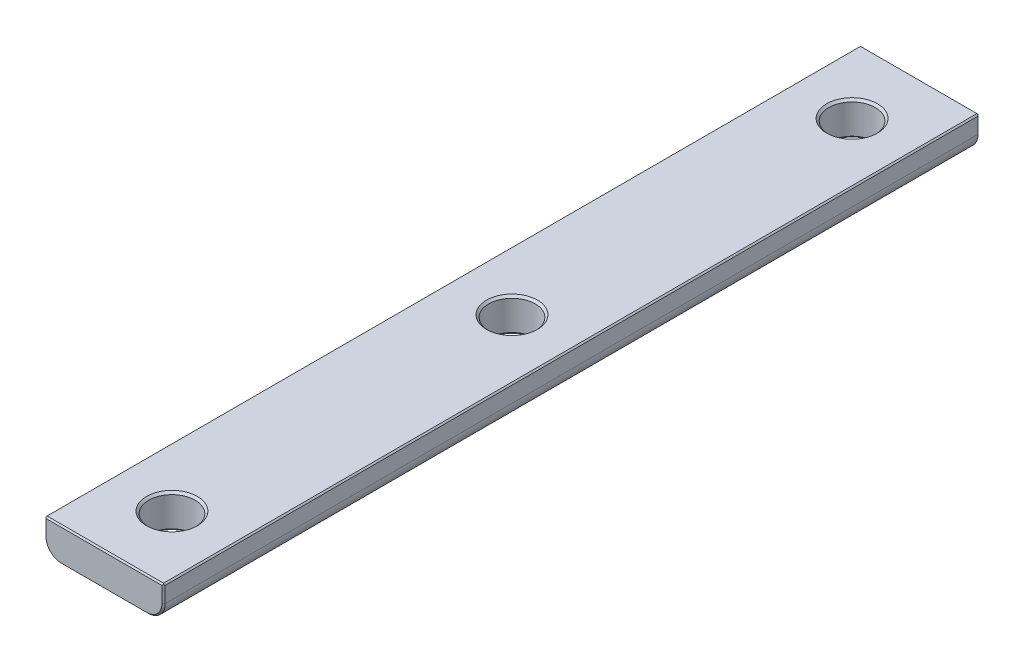
ISO-10303-21;
HEADER;
FILE_DESCRIPTION(('STEP AP214'),'2;1');
FILE_NAME('part.step','',(''),(''),'','','');
FILE_SCHEMA(('AUTOMOTIVE_DESIGN { 1 0 10303 214 1 1 1 1 }'));
ENDSEC;
DATA;
#1=APPLICATION_CONTEXT('core data for automotive mechanical design processes');
#2=APPLICATION_PROTOCOL_DEFINITION('international standard','automotive_design',2000,#1);
#3=PRODUCT_CONTEXT('',#1,'mechanical');
#4=PRODUCT('Part','Part','',(#3));
#5=PRODUCT_RELATED_PRODUCT_CATEGORY('part','',(#4));
#6=PRODUCT_DEFINITION_FORMATION('','',#4);
#7=PRODUCT_DEFINITION_CONTEXT('part definition',#1,'design');
#8=PRODUCT_DEFINITION('design','',#6,#7);
#9=PRODUCT_DEFINITION_SHAPE('','',#8);
#10=(LENGTH_UNIT() NAMED_UNIT(*) SI_UNIT(.MILLI.,.METRE.));
#11=(NAMED_UNIT(*) PLANE_ANGLE_UNIT() SI_UNIT($,.RADIAN.));
#12=(NAMED_UNIT(*) SI_UNIT($,.STERADIAN.) SOLID_ANGLE_UNIT());
#13=UNCERTAINTY_MEASURE_WITH_UNIT(LENGTH_MEASURE(1.E-05),#10,'distance_accuracy_value','');
#14=(GEOMETRIC_REPRESENTATION_CONTEXT(3) GLOBAL_UNCERTAINTY_ASSIGNED_CONTEXT((#13)) GLOBAL_UNIT_ASSIGNED_CONTEXT((#10,
#11,#12)) REPRESENTATION_CONTEXT('',''));
#15=CARTESIAN_POINT('',(0.,0.,0.));
#16=DIRECTION('',(0.,0.,1.));
#17=DIRECTION('',(1.,0.,0.));
#18=AXIS2_PLACEMENT_3D('',#15,#16,#17);
#19=CARTESIAN_POINT('',(4.147312,6.5659,-39.465504));
#20=DIRECTION('',(0.,-1.,0.));
#21=DIRECTION('',(0.,0.,1.));
#22=AXIS2_PLACEMENT_3D('',#19,#20,#21);
#23=PLANE('',#22);
#24=CARTESIAN_POINT('',(0.,6.56590000000372,-31.75));
#25=DIRECTION('',(0.,-1.,0.));
#26=DIRECTION('',(0.,0.,-1.));
#27=AXIS2_PLACEMENT_3D('',#24,#25,#26);
#28=CIRCLE('',#27,2.37490000000372);
#29=CARTESIAN_POINT('',(0.,6.56590000000372,-34.1249000000037));
#30=VERTEX_POINT('',#29);
#31=EDGE_CURVE('E189',#30,#30,#28,.F.);
#32=ORIENTED_EDGE('',*,*,#31,.T.);
#33=EDGE_LOOP('',(#32));
#34=FACE_BOUND('',#33,.T.);
#35=CARTESIAN_POINT('',(0.,6.56590000000373,31.75));
#36=DIRECTION('',(0.,-1.,0.));
#37=DIRECTION('',(1.,0.,0.));
#38=AXIS2_PLACEMENT_3D('',#35,#36,#37);
#39=CIRCLE('',#38,2.37490000000372);
#40=CARTESIAN_POINT('',(2.37490000000372,6.56590000000373,31.75));
#41=VERTEX_POINT('',#40);
#42=EDGE_CURVE('E192',#41,#41,#39,.F.);
#43=ORIENTED_EDGE('',*,*,#42,.T.);
#44=EDGE_LOOP('',(#43));
#45=FACE_BOUND('',#44,.T.);
#46=CARTESIAN_POINT('',(0.,6.56590000000037,0.));
#47=DIRECTION('',(0.,-1.,0.));
#48=DIRECTION('',(0.,0.,-1.));
#49=AXIS2_PLACEMENT_3D('',#46,#47,#48);
#50=CIRCLE('',#49,2.37490000000037);
#51=CARTESIAN_POINT('',(0.,6.56590000000037,-2.37490000000037));
#52=VERTEX_POINT('',#51);
#53=EDGE_CURVE('E195',#52,#52,#50,.F.);
#54=ORIENTED_EDGE('',*,*,#53,.T.);
#55=EDGE_LOOP('',(#54));
#56=FACE_BOUND('',#55,.T.);
#57=DIRECTION('',(0.,0.,1.));
#58=VECTOR('',#57,1.);
#59=CARTESIAN_POINT('',(3.9878,6.5659,0.));
#60=LINE('',#59,#58);
#61=CARTESIAN_POINT('',(3.9878,6.56590000000164,-37.9475999999984));
#62=VERTEX_POINT('',#61);
#63=CARTESIAN_POINT('',(3.9878,6.56590000000245,37.9475999999976));
#64=VERTEX_POINT('',#63);
#65=EDGE_CURVE('E117',#62,#64,#60,.T.);
#66=ORIENTED_EDGE('',*,*,#65,.T.);
#67=DIRECTION('',(-1.,0.,0.));
#68=VECTOR('',#67,1.);
#69=CARTESIAN_POINT('',(0.,6.56590000000327,37.9475999999967));
#70=LINE('',#69,#68);
#71=CARTESIAN_POINT('',(-3.9878,6.56590000000164,37.9475999999984));
#72=VERTEX_POINT('',#71);
#73=EDGE_CURVE('E271',#64,#72,#70,.T.);
#74=ORIENTED_EDGE('',*,*,#73,.T.);
#75=DIRECTION('',(0.,0.,-1.));
#76=VECTOR('',#75,1.);
#77=CARTESIAN_POINT('',(-3.9878,6.5659,0.));
#78=LINE('',#77,#76);
#79=CARTESIAN_POINT('',(-3.9878,6.56590000000164,-37.947599999998));
#80=VERTEX_POINT('',#79);
#81=EDGE_CURVE('E244',#72,#80,#78,.T.);
#82=ORIENTED_EDGE('',*,*,#81,.T.);
#83=DIRECTION('',(1.,0.,0.));
#84=VECTOR('',#83,1.);
#85=CARTESIAN_POINT('',(0.,6.56590000000327,-37.9475999999967));
#86=LINE('',#85,#84);
#87=EDGE_CURVE('E144',#80,#62,#86,.T.);
#88=ORIENTED_EDGE('',*,*,#87,.T.);
#89=EDGE_LOOP('',(#66,#74,#82,#88));
#90=FACE_BOUND('',#89,.T.);
#91=ADVANCED_FACE('F15',(#34,#45,#56,#90),#23,.T.);
#92=CARTESIAN_POINT('',(-3.9878,8.1407,-37.9475999999967));
#93=DIRECTION('',(0.,0.,1.));
#94=DIRECTION('',(1.,0.,0.));
#95=AXIS2_PLACEMENT_3D('',#92,#93,#94);
#96=CONICAL_SURFACE('',#95,1.57479999999673,0.785398163354578);
#97=CARTESIAN_POINT('',(-3.9878,8.1407,-37.9476));
#98=DIRECTION('',(0.,0.,-1.));
#99=DIRECTION('',(0.,-1.,0.));
#100=AXIS2_PLACEMENT_3D('',#97,#98,#99);
#101=CIRCLE('',#100,1.5748);
#102=CARTESIAN_POINT('',(-5.56259999999918,8.1407,-37.947599999999));
#103=VERTEX_POINT('',#102);
#104=EDGE_CURVE('E209',#80,#103,#101,.T.);
#105=ORIENTED_EDGE('',*,*,#104,.T.);
#106=DIRECTION('',(-0.707106781156225,0.,0.70710678121687));
#107=VECTOR('',#106,1.);
#108=CARTESIAN_POINT('',(-5.4864,8.1407,-38.0238));
#109=LINE('',#108,#107);
#110=CARTESIAN_POINT('',(-5.41020000000164,8.1407,-38.1000000000033));
#111=VERTEX_POINT('',#110);
#112=EDGE_CURVE('E203',#103,#111,#109,.F.);
#113=ORIENTED_EDGE('',*,*,#112,.T.);
#114=CARTESIAN_POINT('',(-3.9878,8.1407,-38.1000000000033));
#115=DIRECTION('',(0.,0.,1.));
#116=DIRECTION('',(1.,0.,0.));
#117=AXIS2_PLACEMENT_3D('',#114,#115,#116);
#118=CIRCLE('',#117,1.42240000000327);
#119=CARTESIAN_POINT('',(-3.9878,6.71829999999837,-38.1000000000033));
#120=VERTEX_POINT('',#119);
#121=EDGE_CURVE('E186',#111,#120,#118,.T.);
#122=ORIENTED_EDGE('',*,*,#121,.T.);
#123=DIRECTION('',(0.,-0.707106781156225,0.70710678121687));
#124=VECTOR('',#123,1.);
#125=CARTESIAN_POINT('',(-3.9878,6.6421,-38.0238));
#126=LINE('',#125,#124);
#127=EDGE_CURVE('E147',#120,#80,#126,.T.);
#128=ORIENTED_EDGE('',*,*,#127,.T.);
#129=EDGE_LOOP('',(#105,#113,#122,#128));
#130=FACE_BOUND('',#129,.T.);
#131=ADVANCED_FACE('F321',(#130),#96,.T.);
#132=CARTESIAN_POINT('',(-4.147312,6.4940223329733,-37.8757223329606));
#133=DIRECTION('',(0.,0.70710678121687,0.707106781156225));
#134=DIRECTION('',(1.,0.,0.));
#135=AXIS2_PLACEMENT_3D('',#132,#133,#134);
#136=PLANE('',#135);
#137=DIRECTION('',(-1.,0.,0.));
#138=VECTOR('',#137,1.);
#139=CARTESIAN_POINT('',(0.,6.7183,-38.1));
#140=LINE('',#139,#138);
#141=CARTESIAN_POINT('',(3.9878,6.71829999999837,-38.1000000000033));
#142=VERTEX_POINT('',#141);
#143=EDGE_CURVE('E185',#120,#142,#140,.F.);
#144=ORIENTED_EDGE('',*,*,#143,.T.);
#145=DIRECTION('',(0.,-0.707106781156225,0.70710678121687));
#146=VECTOR('',#145,1.);
#147=CARTESIAN_POINT('',(3.9878,6.6421,-38.0238));
#148=LINE('',#147,#146);
#149=EDGE_CURVE('E225',#142,#62,#148,.T.);
#150=ORIENTED_EDGE('',*,*,#149,.T.);
#151=ORIENTED_EDGE('',*,*,#87,.F.);
#152=ORIENTED_EDGE('',*,*,#127,.F.);
#153=EDGE_LOOP('',(#144,#150,#151,#152));
#154=FACE_BOUND('',#153,.T.);
#155=ADVANCED_FACE('F308',(#154),#136,.F.);
#156=CARTESIAN_POINT('',(3.9878,8.1407,-38.1000000000033));
#157=DIRECTION('',(0.,0.,1.));
#158=DIRECTION('',(1.,0.,0.));
#159=AXIS2_PLACEMENT_3D('',#156,#157,#158);
#160=CONICAL_SURFACE('',#159,1.42240000000327,0.78539816335457);
#161=CARTESIAN_POINT('',(3.9878,8.1407,-37.9476));
#162=DIRECTION('',(0.,0.,1.));
#163=DIRECTION('',(0.,-1.,0.));
#164=AXIS2_PLACEMENT_3D('',#161,#162,#163);
#165=CIRCLE('',#164,1.5748);
#166=CARTESIAN_POINT('',(5.56259999999918,8.1407,-37.947599999999));
#167=VERTEX_POINT('',#166);
#168=EDGE_CURVE('E228',#167,#62,#165,.F.);
#169=ORIENTED_EDGE('',*,*,#168,.T.);
#170=ORIENTED_EDGE('',*,*,#149,.F.);
#171=CARTESIAN_POINT('',(3.9878,8.1407,-38.1000000000033));
#172=DIRECTION('',(0.,0.,1.));
#173=DIRECTION('',(1.,0.,0.));
#174=AXIS2_PLACEMENT_3D('',#171,#172,#173);
#175=CIRCLE('',#174,1.42240000000327);
#176=CARTESIAN_POINT('',(5.41020000000163,8.1407,-38.1000000000033));
#177=VERTEX_POINT('',#176);
#178=EDGE_CURVE('E181',#142,#177,#175,.T.);
#179=ORIENTED_EDGE('',*,*,#178,.T.);
#180=DIRECTION('',(-0.707106781156225,0.,-0.70710678121687));
#181=VECTOR('',#180,1.);
#182=CARTESIAN_POINT('',(5.4864,8.1407,-38.0238));
#183=LINE('',#182,#181);
#184=EDGE_CURVE('E214',#177,#167,#183,.F.);
#185=ORIENTED_EDGE('',*,*,#184,.T.);
#186=EDGE_LOOP('',(#169,#170,#179,#185));
#187=FACE_BOUND('',#186,.T.);
#188=ADVANCED_FACE('F294',(#187),#160,.T.);
#189=CARTESIAN_POINT('',(3.9878,8.1407,-37.9476));
#190=DIRECTION('',(0.,0.,1.));
#191=DIRECTION('',(1.,0.,0.));
#192=AXIS2_PLACEMENT_3D('',#189,#190,#191);
#193=CYLINDRICAL_SURFACE('',#192,1.5748);
#194=ORIENTED_EDGE('',*,*,#65,.F.);
#195=ORIENTED_EDGE('',*,*,#168,.F.);
#196=DIRECTION('',(0.,0.,-1.));
#197=VECTOR('',#196,1.);
#198=CARTESIAN_POINT('',(5.5626,8.1407,0.));
#199=LINE('',#198,#197);
#200=CARTESIAN_POINT('',(5.56259999999837,8.1407,37.9475999999976));
#201=VERTEX_POINT('',#200);
#202=EDGE_CURVE('E125',#167,#201,#199,.F.);
#203=ORIENTED_EDGE('',*,*,#202,.T.);
#204=CARTESIAN_POINT('',(3.9878,8.1407,37.9475999999967));
#205=DIRECTION('',(0.,0.,1.));
#206=DIRECTION('',(0.,-1.,0.));
#207=AXIS2_PLACEMENT_3D('',#204,#205,#206);
#208=CIRCLE('',#207,1.57479999999673);
#209=EDGE_CURVE('E268',#201,#64,#208,.F.);
#210=ORIENTED_EDGE('',*,*,#209,.T.);
#211=EDGE_LOOP('',(#194,#195,#203,#210));
#212=FACE_BOUND('',#211,.T.);
#213=ADVANCED_FACE('F300',(#212),#193,.T.);
#214=CARTESIAN_POINT('',(5.6344776670267,9.79175037154264,-37.8757223329606));
#215=DIRECTION('',(0.70710678121687,0.,-0.707106781156225));
#216=DIRECTION('',(0.,-1.,0.));
#217=AXIS2_PLACEMENT_3D('',#214,#215,#216);
#218=PLANE('',#217);
#219=DIRECTION('',(0.,-1.,0.));
#220=VECTOR('',#219,1.);
#221=CARTESIAN_POINT('',(5.4102,8.1661,-38.1));
#222=LINE('',#221,#220);
#223=CARTESIAN_POINT('',(5.41020000000245,9.61390000000205,-38.1000000000015));
#224=VERTEX_POINT('',#223);
#225=EDGE_CURVE('E184',#177,#224,#222,.F.);
#226=ORIENTED_EDGE('',*,*,#225,.T.);
#227=DIRECTION('',(-0.577350269164863,-0.577350269177639,-0.577350269226375));
#228=VECTOR('',#227,1.);
#229=CARTESIAN_POINT('',(5.4864,9.69009999999883,-38.0237999999988));
#230=LINE('',#229,#228);
#231=CARTESIAN_POINT('',(5.48639999999979,9.69009999999855,-38.0237999999992));
#232=VERTEX_POINT('',#231);
#233=EDGE_CURVE('E113',#232,#224,#230,.T.);
#234=ORIENTED_EDGE('',*,*,#233,.F.);
#235=DIRECTION('',(-0.577350269174537,0.577350269179952,-0.577350269214388));
#236=VECTOR('',#235,1.);
#237=CARTESIAN_POINT('',(5.56259999999743,9.6139000000007,-37.9475999999967));
#238=LINE('',#237,#236);
#239=CARTESIAN_POINT('',(5.5625999999993,9.61389999999907,-37.9475999999975));
#240=VERTEX_POINT('',#239);
#241=EDGE_CURVE('E19',#240,#232,#238,.T.);
#242=ORIENTED_EDGE('',*,*,#241,.F.);
#243=DIRECTION('',(0.,1.,0.));
#244=VECTOR('',#243,1.);
#245=CARTESIAN_POINT('',(5.5626,8.8773,-37.9476));
#246=LINE('',#245,#244);
#247=EDGE_CURVE('E112',#240,#167,#246,.F.);
#248=ORIENTED_EDGE('',*,*,#247,.T.);
#249=ORIENTED_EDGE('',*,*,#184,.F.);
#250=EDGE_LOOP('',(#226,#234,#242,#248,#249));
#251=FACE_BOUND('',#250,.T.);
#252=ADVANCED_FACE('F111',(#251),#218,.T.);
#253=CARTESIAN_POINT('',(-3.9878,8.1407,38.1000000000033));
#254=DIRECTION('',(0.,0.,-1.));
#255=DIRECTION('',(-1.,0.,0.));
#256=AXIS2_PLACEMENT_3D('',#253,#254,#255);
#257=CONICAL_SURFACE('',#256,1.42240000000327,0.78539816335457);
#258=CARTESIAN_POINT('',(-3.9878,8.1407,37.9476));
#259=DIRECTION('',(0.,0.,-1.));
#260=DIRECTION('',(0.,-1.,0.));
#261=AXIS2_PLACEMENT_3D('',#258,#259,#260);
#262=CIRCLE('',#261,1.5748);
#263=CARTESIAN_POINT('',(-5.56259999999918,8.1407,37.9475999999984));
#264=VERTEX_POINT('',#263);
#265=EDGE_CURVE('E241',#264,#72,#262,.F.);
#266=ORIENTED_EDGE('',*,*,#265,.T.);
#267=DIRECTION('',(0.,0.707106781156225,0.70710678121687));
#268=VECTOR('',#267,1.);
#269=CARTESIAN_POINT('',(-3.9878,6.6421,38.0238));
#270=LINE('',#269,#268);
#271=CARTESIAN_POINT('',(-3.9878,6.71829999999837,38.1000000000033));
#272=VERTEX_POINT('',#271);
#273=EDGE_CURVE('E276',#72,#272,#270,.T.);
#274=ORIENTED_EDGE('',*,*,#273,.T.);
#275=CARTESIAN_POINT('',(-3.9878,8.1407,38.1000000000033));
#276=DIRECTION('',(0.,0.,-1.));
#277=DIRECTION('',(-1.,0.,0.));
#278=AXIS2_PLACEMENT_3D('',#275,#276,#277);
#279=CIRCLE('',#278,1.42240000000327);
#280=CARTESIAN_POINT('',(-5.41020000000164,8.1407,38.1000000000033));
#281=VERTEX_POINT('',#280);
#282=EDGE_CURVE('E127',#272,#281,#279,.T.);
#283=ORIENTED_EDGE('',*,*,#282,.T.);
#284=DIRECTION('',(0.707106781156225,0.,0.70710678121687));
#285=VECTOR('',#284,1.);
#286=CARTESIAN_POINT('',(-5.4864,8.1407,38.0238));
#287=LINE('',#286,#285);
#288=EDGE_CURVE('E198',#281,#264,#287,.F.);
#289=ORIENTED_EDGE('',*,*,#288,.T.);
#290=EDGE_LOOP('',(#266,#274,#283,#289));
#291=FACE_BOUND('',#290,.T.);
#292=ADVANCED_FACE('F361',(#291),#257,.T.);
#293=CARTESIAN_POINT('',(5.3383223329733,9.79175037154264,38.1718776670394));
#294=DIRECTION('',(0.70710678121687,0.,0.707106781156225));
#295=DIRECTION('',(0.,-1.,0.));
#296=AXIS2_PLACEMENT_3D('',#293,#294,#295);
#297=PLANE('',#296);
#298=DIRECTION('',(0.,-1.,0.));
#299=VECTOR('',#298,1.);
#300=CARTESIAN_POINT('',(5.5626,8.8773,37.9476));
#301=LINE('',#300,#299);
#302=CARTESIAN_POINT('',(5.5625999999993,9.61389999999907,37.9475999999976));
#303=VERTEX_POINT('',#302);
#304=EDGE_CURVE('E128',#201,#303,#301,.F.);
#305=ORIENTED_EDGE('',*,*,#304,.T.);
#306=DIRECTION('',(0.577350269174519,-0.577350269179934,-0.577350269214423));
#307=VECTOR('',#306,1.);
#308=CARTESIAN_POINT('',(5.48639999999943,9.69009999999943,38.0238));
#309=LINE('',#308,#307);
#310=CARTESIAN_POINT('',(5.48640000000016,9.69009999999869,38.023799999999));
#311=VERTEX_POINT('',#310);
#312=EDGE_CURVE('E132',#311,#303,#309,.T.);
#313=ORIENTED_EDGE('',*,*,#312,.F.);
#314=DIRECTION('',(0.577350269164868,0.577350269177637,-0.577350269226373));
#315=VECTOR('',#314,1.);
#316=CARTESIAN_POINT('',(5.41020000000327,9.61390000000042,38.1000000000037));
#317=LINE('',#316,#315);
#318=CARTESIAN_POINT('',(5.41020000000245,9.61390000000205,38.1000000000015));
#319=VERTEX_POINT('',#318);
#320=EDGE_CURVE('E212',#319,#311,#317,.T.);
#321=ORIENTED_EDGE('',*,*,#320,.F.);
#322=DIRECTION('',(0.,1.,0.));
#323=VECTOR('',#322,1.);
#324=CARTESIAN_POINT('',(5.4102,8.1661,38.1));
#325=LINE('',#324,#323);
#326=CARTESIAN_POINT('',(5.41020000000163,8.1407,38.1000000000033));
#327=VERTEX_POINT('',#326);
#328=EDGE_CURVE('E177',#319,#327,#325,.F.);
#329=ORIENTED_EDGE('',*,*,#328,.T.);
#330=DIRECTION('',(0.707106781156225,0.,-0.70710678121687));
#331=VECTOR('',#330,1.);
#332=CARTESIAN_POINT('',(5.4864,8.1407,38.0238));
#333=LINE('',#332,#331);
#334=EDGE_CURVE('E211',#327,#201,#333,.T.);
#335=ORIENTED_EDGE('',*,*,#334,.T.);
#336=EDGE_LOOP('',(#305,#313,#321,#329,#335));
#337=FACE_BOUND('',#336,.T.);
#338=ADVANCED_FACE('F392',(#337),#297,.T.);
#339=CARTESIAN_POINT('',(3.9878,8.1407,37.9475999999967));
#340=DIRECTION('',(0.,0.,-1.));
#341=DIRECTION('',(-1.,0.,0.));
#342=AXIS2_PLACEMENT_3D('',#339,#340,#341);
#343=CONICAL_SURFACE('',#342,1.57479999999673,0.785398163354578);
#344=ORIENTED_EDGE('',*,*,#209,.F.);
#345=ORIENTED_EDGE('',*,*,#334,.F.);
#346=CARTESIAN_POINT('',(3.9878,8.1407,38.1000000000033));
#347=DIRECTION('',(0.,0.,-1.));
#348=DIRECTION('',(-1.,0.,0.));
#349=AXIS2_PLACEMENT_3D('',#346,#347,#348);
#350=CIRCLE('',#349,1.42240000000327);
#351=CARTESIAN_POINT('',(3.9878,6.71829999999837,38.1000000000033));
#352=VERTEX_POINT('',#351);
#353=EDGE_CURVE('E173',#327,#352,#350,.T.);
#354=ORIENTED_EDGE('',*,*,#353,.T.);
#355=DIRECTION('',(0.,-0.707106781156225,-0.70710678121687));
#356=VECTOR('',#355,1.);
#357=CARTESIAN_POINT('',(3.9878,6.6421,38.0238));
#358=LINE('',#357,#356);
#359=EDGE_CURVE('E245',#352,#64,#358,.T.);
#360=ORIENTED_EDGE('',*,*,#359,.T.);
#361=EDGE_LOOP('',(#344,#345,#354,#360));
#362=FACE_BOUND('',#361,.T.);
#363=ADVANCED_FACE('F384',(#362),#343,.T.);
#364=CARTESIAN_POINT('',(4.147312,6.4940223329733,37.8757223329606));
#365=DIRECTION('',(0.,0.70710678121687,-0.707106781156225));
#366=DIRECTION('',(-1.,0.,0.));
#367=AXIS2_PLACEMENT_3D('',#364,#365,#366);
#368=PLANE('',#367);
#369=DIRECTION('',(1.,0.,0.));
#370=VECTOR('',#369,1.);
#371=CARTESIAN_POINT('',(0.,6.7183,38.1));
#372=LINE('',#371,#370);
#373=EDGE_CURVE('E176',#352,#272,#372,.F.);
#374=ORIENTED_EDGE('',*,*,#373,.T.);
#375=ORIENTED_EDGE('',*,*,#273,.F.);
#376=ORIENTED_EDGE('',*,*,#73,.F.);
#377=ORIENTED_EDGE('',*,*,#359,.F.);
#378=EDGE_LOOP('',(#374,#375,#376,#377));
#379=FACE_BOUND('',#378,.T.);
#380=ADVANCED_FACE('F382',(#379),#368,.F.);
#381=CARTESIAN_POINT('',(-3.9878,8.1407,37.9476));
#382=DIRECTION('',(0.,0.,-1.));
#383=DIRECTION('',(-1.,0.,0.));
#384=AXIS2_PLACEMENT_3D('',#381,#382,#383);
#385=CYLINDRICAL_SURFACE('',#384,1.5748);
#386=ORIENTED_EDGE('',*,*,#81,.F.);
#387=ORIENTED_EDGE('',*,*,#265,.F.);
#388=DIRECTION('',(0.,0.,1.));
#389=VECTOR('',#388,1.);
#390=CARTESIAN_POINT('',(-5.5626,8.1407,0.));
#391=LINE('',#390,#389);
#392=EDGE_CURVE('E235',#264,#103,#391,.F.);
#393=ORIENTED_EDGE('',*,*,#392,.T.);
#394=ORIENTED_EDGE('',*,*,#104,.F.);
#395=EDGE_LOOP('',(#386,#387,#393,#394));
#396=FACE_BOUND('',#395,.T.);
#397=ADVANCED_FACE('F316',(#396),#385,.T.);
#398=CARTESIAN_POINT('',(-5.3383223329733,9.79175037154264,-38.1718776670394));
#399=DIRECTION('',(-0.70710678121687,0.,-0.707106781156225));
#400=DIRECTION('',(0.,-1.,0.));
#401=AXIS2_PLACEMENT_3D('',#398,#399,#400);
#402=PLANE('',#401);
#403=DIRECTION('',(0.,-1.,0.));
#404=VECTOR('',#403,1.);
#405=CARTESIAN_POINT('',(-5.5626,8.8773,-37.9476));
#406=LINE('',#405,#404);
#407=CARTESIAN_POINT('',(-5.5625999999993,9.61389999999907,-37.9475999999976));
#408=VERTEX_POINT('',#407);
#409=EDGE_CURVE('E238',#103,#408,#406,.F.);
#410=ORIENTED_EDGE('',*,*,#409,.T.);
#411=DIRECTION('',(-0.577350269174519,-0.577350269179941,0.577350269214417));
#412=VECTOR('',#411,1.);
#413=CARTESIAN_POINT('',(-5.48639999999943,9.69009999999943,-38.0238));
#414=LINE('',#413,#412);
#415=CARTESIAN_POINT('',(-5.48639999999979,9.69009999999855,-38.0237999999992));
#416=VERTEX_POINT('',#415);
#417=EDGE_CURVE('E204',#416,#408,#414,.T.);
#418=ORIENTED_EDGE('',*,*,#417,.F.);
#419=DIRECTION('',(-0.577350269164841,0.577350269177643,0.577350269226393));
#420=VECTOR('',#419,1.);
#421=CARTESIAN_POINT('',(-5.41020000000327,9.61390000000041,-38.1000000000037));
#422=LINE('',#421,#420);
#423=CARTESIAN_POINT('',(-5.41020000000245,9.61390000000205,-38.1000000000015));
#424=VERTEX_POINT('',#423);
#425=EDGE_CURVE('E206',#424,#416,#422,.T.);
#426=ORIENTED_EDGE('',*,*,#425,.F.);
#427=DIRECTION('',(0.,1.,0.));
#428=VECTOR('',#427,1.);
#429=CARTESIAN_POINT('',(-5.4102,8.1661,-38.1));
#430=LINE('',#429,#428);
#431=EDGE_CURVE('E284',#424,#111,#430,.F.);
#432=ORIENTED_EDGE('',*,*,#431,.T.);
#433=ORIENTED_EDGE('',*,*,#112,.F.);
#434=EDGE_LOOP('',(#410,#418,#426,#432,#433));
#435=FACE_BOUND('',#434,.T.);
#436=ADVANCED_FACE('F374',(#435),#402,.T.);
#437=CARTESIAN_POINT('',(-5.6344776670267,9.79175037154264,37.8757223329606));
#438=DIRECTION('',(-0.70710678121687,0.,0.707106781156225));
#439=DIRECTION('',(0.,-1.,0.));
#440=AXIS2_PLACEMENT_3D('',#437,#438,#439);
#441=PLANE('',#440);
#442=DIRECTION('',(0.,-1.,0.));
#443=VECTOR('',#442,1.);
#444=CARTESIAN_POINT('',(-5.4102,8.1661,38.1));
#445=LINE('',#444,#443);
#446=CARTESIAN_POINT('',(-5.41020000000245,9.61390000000205,38.1000000000015));
#447=VERTEX_POINT('',#446);
#448=EDGE_CURVE('E180',#281,#447,#445,.F.);
#449=ORIENTED_EDGE('',*,*,#448,.T.);
#450=DIRECTION('',(0.577350269164863,-0.577350269177639,0.577350269226375));
#451=VECTOR('',#450,1.);
#452=CARTESIAN_POINT('',(-5.4864,9.69009999999883,38.0237999999988));
#453=LINE('',#452,#451);
#454=CARTESIAN_POINT('',(-5.48639999999979,9.69009999999855,38.0237999999992));
#455=VERTEX_POINT('',#454);
#456=EDGE_CURVE('E199',#455,#447,#453,.T.);
#457=ORIENTED_EDGE('',*,*,#456,.F.);
#458=DIRECTION('',(0.577350269174537,0.577350269179952,0.577350269214388));
#459=VECTOR('',#458,1.);
#460=CARTESIAN_POINT('',(-5.56259999999743,9.6139000000007,37.9475999999967));
#461=LINE('',#460,#459);
#462=CARTESIAN_POINT('',(-5.5625999999993,9.61389999999907,37.9475999999975));
#463=VERTEX_POINT('',#462);
#464=EDGE_CURVE('E201',#463,#455,#461,.T.);
#465=ORIENTED_EDGE('',*,*,#464,.F.);
#466=DIRECTION('',(0.,1.,0.));
#467=VECTOR('',#466,1.);
#468=CARTESIAN_POINT('',(-5.5626,8.8773,37.9476));
#469=LINE('',#468,#467);
#470=EDGE_CURVE('E248',#463,#264,#469,.F.);
#471=ORIENTED_EDGE('',*,*,#470,.T.);
#472=ORIENTED_EDGE('',*,*,#288,.F.);
#473=EDGE_LOOP('',(#449,#457,#465,#471,#472));
#474=FACE_BOUND('',#473,.T.);
#475=ADVANCED_FACE('F367',(#474),#441,.T.);
#476=CARTESIAN_POINT('',(0.,6.56590000000037,0.));
#477=DIRECTION('',(0.,-1.,0.));
#478=DIRECTION('',(0.,0.,-1.));
#479=AXIS2_PLACEMENT_3D('',#476,#477,#478);
#480=CONICAL_SURFACE('',#479,2.37490000000037,0.785398163401112);
#481=CARTESIAN_POINT('',(0.,6.7691,0.));
#482=DIRECTION('',(0.,1.,0.));
#483=DIRECTION('',(0.,0.,1.));
#484=AXIS2_PLACEMENT_3D('',#481,#482,#483);
#485=CIRCLE('',#484,2.1717);
#486=CARTESIAN_POINT('',(0.,6.7691,2.1717));
#487=VERTEX_POINT('',#486);
#488=EDGE_CURVE('E251',#487,#487,#485,.T.);
#489=ORIENTED_EDGE('',*,*,#488,.T.);
#490=EDGE_LOOP('',(#489));
#491=FACE_BOUND('',#490,.T.);
#492=ORIENTED_EDGE('',*,*,#53,.F.);
#493=EDGE_LOOP('',(#492));
#494=FACE_BOUND('',#493,.T.);
#495=ADVANCED_FACE('F457',(#491,#494),#480,.F.);
#496=CARTESIAN_POINT('',(0.,6.56590000000372,31.75));
#497=DIRECTION('',(0.,-1.,0.));
#498=DIRECTION('',(1.,0.,0.));
#499=AXIS2_PLACEMENT_3D('',#496,#497,#498);
#500=CONICAL_SURFACE('',#499,2.37490000000373,0.785398163434057);
#501=CARTESIAN_POINT('',(0.,6.7691,31.75));
#502=DIRECTION('',(0.,1.,0.));
#503=DIRECTION('',(0.,0.,1.));
#504=AXIS2_PLACEMENT_3D('',#501,#502,#503);
#505=CIRCLE('',#504,2.1717);
#506=CARTESIAN_POINT('',(0.,6.7691,33.9217));
#507=VERTEX_POINT('',#506);
#508=EDGE_CURVE('E336',#507,#507,#505,.T.);
#509=ORIENTED_EDGE('',*,*,#508,.T.);
#510=EDGE_LOOP('',(#509));
#511=FACE_BOUND('',#510,.T.);
#512=ORIENTED_EDGE('',*,*,#42,.F.);
#513=EDGE_LOOP('',(#512));
#514=FACE_BOUND('',#513,.T.);
#515=ADVANCED_FACE('F453',(#511,#514),#500,.F.);
#516=CARTESIAN_POINT('',(0.,6.56590000000372,-31.75));
#517=DIRECTION('',(0.,-1.,0.));
#518=DIRECTION('',(0.,0.,-1.));
#519=AXIS2_PLACEMENT_3D('',#516,#517,#518);
#520=CONICAL_SURFACE('',#519,2.37490000000372,0.785398163434057);
#521=CARTESIAN_POINT('',(0.,6.7691,-31.75));
#522=DIRECTION('',(0.,1.,0.));
#523=DIRECTION('',(0.,0.,1.));
#524=AXIS2_PLACEMENT_3D('',#521,#522,#523);
#525=CIRCLE('',#524,2.1717);
#526=CARTESIAN_POINT('',(0.,6.7691,-29.5783));
#527=VERTEX_POINT('',#526);
#528=EDGE_CURVE('E333',#527,#527,#525,.T.);
#529=ORIENTED_EDGE('',*,*,#528,.T.);
#530=EDGE_LOOP('',(#529));
#531=FACE_BOUND('',#530,.T.);
#532=ORIENTED_EDGE('',*,*,#31,.F.);
#533=EDGE_LOOP('',(#532));
#534=FACE_BOUND('',#533,.T.);
#535=ADVANCED_FACE('F450',(#531,#534),#520,.F.);
#536=CARTESIAN_POINT('',(-5.626608,9.71555037154264,-38.1));
#537=DIRECTION('',(0.,0.,-1.));
#538=DIRECTION('',(1.,0.,0.));
#539=AXIS2_PLACEMENT_3D('',#536,#537,#538);
#540=PLANE('',#539);
#541=DIRECTION('',(-1.,0.,0.));
#542=VECTOR('',#541,1.);
#543=CARTESIAN_POINT('',(0.,9.61390000000205,-38.100000000002));
#544=LINE('',#543,#542);
#545=EDGE_CURVE('E139',#424,#224,#544,.F.);
#546=ORIENTED_EDGE('',*,*,#545,.T.);
#547=ORIENTED_EDGE('',*,*,#225,.F.);
#548=ORIENTED_EDGE('',*,*,#178,.F.);
#549=ORIENTED_EDGE('',*,*,#143,.F.);
#550=ORIENTED_EDGE('',*,*,#121,.F.);
#551=ORIENTED_EDGE('',*,*,#431,.F.);
#552=EDGE_LOOP('',(#546,#547,#548,#549,#550,#551));
#553=FACE_BOUND('',#552,.T.);
#554=ADVANCED_FACE('F327',(#553),#540,.T.);
#555=CARTESIAN_POINT('',(5.5626,9.71555037154264,-39.465504));
#556=DIRECTION('',(1.,0.,0.));
#557=DIRECTION('',(0.,0.,1.));
#558=AXIS2_PLACEMENT_3D('',#555,#556,#557);
#559=PLANE('',#558);
#560=DIRECTION('',(0.,0.,-1.));
#561=VECTOR('',#560,1.);
#562=CARTESIAN_POINT('',(5.56259999999907,9.61389999999907,0.));
#563=LINE('',#562,#561);
#564=EDGE_CURVE('E123',#240,#303,#563,.F.);
#565=ORIENTED_EDGE('',*,*,#564,.T.);
#566=ORIENTED_EDGE('',*,*,#304,.F.);
#567=ORIENTED_EDGE('',*,*,#202,.F.);
#568=ORIENTED_EDGE('',*,*,#247,.F.);
#569=EDGE_LOOP('',(#565,#566,#567,#568));
#570=FACE_BOUND('',#569,.T.);
#571=ADVANCED_FACE('F121',(#570),#559,.T.);
#572=CARTESIAN_POINT('',(5.626608,9.71555037154264,38.1));
#573=DIRECTION('',(0.,0.,1.));
#574=DIRECTION('',(-1.,0.,0.));
#575=AXIS2_PLACEMENT_3D('',#572,#573,#574);
#576=PLANE('',#575);
#577=ORIENTED_EDGE('',*,*,#353,.F.);
#578=ORIENTED_EDGE('',*,*,#328,.F.);
#579=DIRECTION('',(1.,0.,0.));
#580=VECTOR('',#579,1.);
#581=CARTESIAN_POINT('',(0.,9.61390000000205,38.100000000002));
#582=LINE('',#581,#580);
#583=EDGE_CURVE('E137',#319,#447,#582,.F.);
#584=ORIENTED_EDGE('',*,*,#583,.T.);
#585=ORIENTED_EDGE('',*,*,#448,.F.);
#586=ORIENTED_EDGE('',*,*,#282,.F.);
#587=ORIENTED_EDGE('',*,*,#373,.F.);
#588=EDGE_LOOP('',(#577,#578,#584,#585,#586,#587));
#589=FACE_BOUND('',#588,.T.);
#590=ADVANCED_FACE('F389',(#589),#576,.T.);
#591=CARTESIAN_POINT('',(-5.5626,9.71555037154264,39.465504));
#592=DIRECTION('',(-1.,0.,0.));
#593=DIRECTION('',(0.,0.,-1.));
#594=AXIS2_PLACEMENT_3D('',#591,#592,#593);
#595=PLANE('',#594);
#596=DIRECTION('',(0.,0.,1.));
#597=VECTOR('',#596,1.);
#598=CARTESIAN_POINT('',(-5.56259999999907,9.61389999999907,0.));
#599=LINE('',#598,#597);
#600=EDGE_CURVE('E171',#463,#408,#599,.F.);
#601=ORIENTED_EDGE('',*,*,#600,.T.);
#602=ORIENTED_EDGE('',*,*,#409,.F.);
#603=ORIENTED_EDGE('',*,*,#392,.F.);
#604=ORIENTED_EDGE('',*,*,#470,.F.);
#605=EDGE_LOOP('',(#601,#602,#603,#604));
#606=FACE_BOUND('',#605,.T.);
#607=ADVANCED_FACE('F370',(#606),#595,.T.);
#608=CARTESIAN_POINT('',(0.,6.7691,0.));
#609=DIRECTION('',(0.,1.,0.));
#610=DIRECTION('',(-1.,0.,0.));
#611=AXIS2_PLACEMENT_3D('',#608,#609,#610);
#612=CYLINDRICAL_SURFACE('',#611,2.1717);
#613=ORIENTED_EDGE('',*,*,#488,.F.);
#614=EDGE_LOOP('',(#613));
#615=FACE_BOUND('',#614,.T.);
#616=CARTESIAN_POINT('',(0.,9.53769999999937,0.));
#617=DIRECTION('',(0.,1.,0.));
#618=DIRECTION('',(0.,0.,1.));
#619=AXIS2_PLACEMENT_3D('',#616,#617,#618);
#620=CIRCLE('',#619,2.17170000000064);
#621=CARTESIAN_POINT('',(0.,9.53769999999937,2.17170000000064));
#622=VERTEX_POINT('',#621);
#623=EDGE_CURVE('E170',#622,#622,#620,.T.);
#624=ORIENTED_EDGE('',*,*,#623,.T.);
#625=EDGE_LOOP('',(#624));
#626=FACE_BOUND('',#625,.T.);
#627=ADVANCED_FACE('F445',(#615,#626),#612,.F.);
#628=CARTESIAN_POINT('',(0.,6.7691,31.75));
#629=DIRECTION('',(0.,1.,0.));
#630=DIRECTION('',(-1.,0.,0.));
#631=AXIS2_PLACEMENT_3D('',#628,#629,#630);
#632=CYLINDRICAL_SURFACE('',#631,2.1717);
#633=ORIENTED_EDGE('',*,*,#508,.F.);
#634=EDGE_LOOP('',(#633));
#635=FACE_BOUND('',#634,.T.);
#636=CARTESIAN_POINT('',(0.,9.53770000000271,31.75));
#637=DIRECTION('',(0.,1.,0.));
#638=DIRECTION('',(0.,0.,1.));
#639=AXIS2_PLACEMENT_3D('',#636,#637,#638);
#640=CIRCLE('',#639,2.17169999999729);
#641=CARTESIAN_POINT('',(0.,9.53770000000271,33.9216999999973));
#642=VERTEX_POINT('',#641);
#643=EDGE_CURVE('E739',#642,#642,#640,.T.);
#644=ORIENTED_EDGE('',*,*,#643,.T.);
#645=EDGE_LOOP('',(#644));
#646=FACE_BOUND('',#645,.T.);
#647=ADVANCED_FACE('F441',(#635,#646),#632,.F.);
#648=CARTESIAN_POINT('',(0.,6.7691,-31.75));
#649=DIRECTION('',(0.,1.,0.));
#650=DIRECTION('',(-1.,0.,0.));
#651=AXIS2_PLACEMENT_3D('',#648,#649,#650);
#652=CYLINDRICAL_SURFACE('',#651,2.1717);
#653=ORIENTED_EDGE('',*,*,#528,.F.);
#654=EDGE_LOOP('',(#653));
#655=FACE_BOUND('',#654,.T.);
#656=CARTESIAN_POINT('',(0.,9.53770000000272,-31.75));
#657=DIRECTION('',(0.,1.,0.));
#658=DIRECTION('',(0.,0.,1.));
#659=AXIS2_PLACEMENT_3D('',#656,#657,#658);
#660=CIRCLE('',#659,2.17169999999729);
#661=CARTESIAN_POINT('',(0.,9.53770000000272,-29.5783000000027));
#662=VERTEX_POINT('',#661);
#663=EDGE_CURVE('E157',#662,#662,#660,.T.);
#664=ORIENTED_EDGE('',*,*,#663,.T.);
#665=EDGE_LOOP('',(#664));
#666=FACE_BOUND('',#665,.T.);
#667=ADVANCED_FACE('F438',(#655,#666),#652,.F.);
#668=CARTESIAN_POINT('',(-5.705856,9.8127776670267,-37.9011223329606));
#669=DIRECTION('',(0.,0.707106781216396,-0.707106781156699));
#670=DIRECTION('',(1.,0.,0.));
#671=AXIS2_PLACEMENT_3D('',#668,#669,#670);
#672=PLANE('',#671);
#673=ORIENTED_EDGE('',*,*,#233,.T.);
#674=ORIENTED_EDGE('',*,*,#545,.F.);
#675=ORIENTED_EDGE('',*,*,#425,.T.);
#676=DIRECTION('',(0.577350269186898,0.577350269166621,0.577350269215358));
#677=VECTOR('',#676,1.);
#678=CARTESIAN_POINT('',(-5.48639999999943,9.69009999999854,-38.0237999999991));
#679=LINE('',#678,#677);
#680=CARTESIAN_POINT('',(-5.43559999999952,9.74089999999952,-37.9729999999976));
#681=VERTEX_POINT('',#680);
#682=EDGE_CURVE('E167',#416,#681,#679,.T.);
#683=ORIENTED_EDGE('',*,*,#682,.T.);
#684=DIRECTION('',(1.,0.,0.));
#685=VECTOR('',#684,1.);
#686=CARTESIAN_POINT('',(0.,9.7409,-37.973));
#687=LINE('',#686,#685);
#688=CARTESIAN_POINT('',(5.43559999999952,9.74089999999952,-37.9729999999976));
#689=VERTEX_POINT('',#688);
#690=EDGE_CURVE('E154',#681,#689,#687,.T.);
#691=ORIENTED_EDGE('',*,*,#690,.T.);
#692=DIRECTION('',(0.577350269186958,-0.577350269166592,-0.577350269215328));
#693=VECTOR('',#692,1.);
#694=CARTESIAN_POINT('',(5.43559999999966,9.74089999999652,-37.9729999999969));
#695=LINE('',#694,#693);
#696=EDGE_CURVE('E135',#689,#232,#695,.T.);
#697=ORIENTED_EDGE('',*,*,#696,.T.);
#698=EDGE_LOOP('',(#673,#674,#675,#683,#691,#697));
#699=FACE_BOUND('',#698,.T.);
#700=ADVANCED_FACE('F397',(#699),#672,.T.);
#701=CARTESIAN_POINT('',(5.3637223329733,9.8127776670267,-39.544752));
#702=DIRECTION('',(0.707106781189864,0.707106781183231,0.));
#703=DIRECTION('',(0.,0.,1.));
#704=AXIS2_PLACEMENT_3D('',#701,#702,#703);
#705=PLANE('',#704);
#706=ORIENTED_EDGE('',*,*,#312,.T.);
#707=ORIENTED_EDGE('',*,*,#564,.F.);
#708=ORIENTED_EDGE('',*,*,#241,.T.);
#709=ORIENTED_EDGE('',*,*,#696,.F.);
#710=DIRECTION('',(0.,0.,1.));
#711=VECTOR('',#710,1.);
#712=CARTESIAN_POINT('',(5.4356,9.7409,0.));
#713=LINE('',#712,#711);
#714=CARTESIAN_POINT('',(5.43559999999992,9.74089999999991,37.9729999999975));
#715=VERTEX_POINT('',#714);
#716=EDGE_CURVE('E150',#689,#715,#713,.T.);
#717=ORIENTED_EDGE('',*,*,#716,.T.);
#718=DIRECTION('',(0.577350269174754,-0.577350269180156,0.577350269213968));
#719=VECTOR('',#718,1.);
#720=CARTESIAN_POINT('',(5.43560000000132,9.74089999999801,37.9729999999967));
#721=LINE('',#720,#719);
#722=EDGE_CURVE('E134',#715,#311,#721,.T.);
#723=ORIENTED_EDGE('',*,*,#722,.T.);
#724=EDGE_LOOP('',(#706,#707,#708,#709,#717,#723));
#725=FACE_BOUND('',#724,.T.);
#726=ADVANCED_FACE('F130',(#725),#705,.T.);
#727=CARTESIAN_POINT('',(5.705856,9.8127776670267,37.9011223329606));
#728=DIRECTION('',(0.,0.707106781216396,0.707106781156699));
#729=DIRECTION('',(-1.,0.,0.));
#730=AXIS2_PLACEMENT_3D('',#727,#728,#729);
#731=PLANE('',#730);
#732=ORIENTED_EDGE('',*,*,#456,.T.);
#733=ORIENTED_EDGE('',*,*,#583,.F.);
#734=ORIENTED_EDGE('',*,*,#320,.T.);
#735=ORIENTED_EDGE('',*,*,#722,.F.);
#736=DIRECTION('',(-1.,0.,0.));
#737=VECTOR('',#736,1.);
#738=CARTESIAN_POINT('',(0.,9.7409,37.973));
#739=LINE('',#738,#737);
#740=CARTESIAN_POINT('',(-5.43559999999952,9.74089999999952,37.9729999999976));
#741=VERTEX_POINT('',#740);
#742=EDGE_CURVE('E153',#715,#741,#739,.T.);
#743=ORIENTED_EDGE('',*,*,#742,.T.);
#744=DIRECTION('',(-0.577350269186958,-0.577350269166592,0.577350269215328));
#745=VECTOR('',#744,1.);
#746=CARTESIAN_POINT('',(-5.43559999999966,9.74089999999652,37.9729999999969));
#747=LINE('',#746,#745);
#748=EDGE_CURVE('E34',#741,#455,#747,.T.);
#749=ORIENTED_EDGE('',*,*,#748,.T.);
#750=EDGE_LOOP('',(#732,#733,#734,#735,#743,#749));
#751=FACE_BOUND('',#750,.T.);
#752=ADVANCED_FACE('F403',(#751),#731,.T.);
#753=CARTESIAN_POINT('',(-5.3637223329733,9.8127776670267,39.544752));
#754=DIRECTION('',(-0.707106781189864,0.707106781183231,0.));
#755=DIRECTION('',(0.,0.,-1.));
#756=AXIS2_PLACEMENT_3D('',#753,#754,#755);
#757=PLANE('',#756);
#758=ORIENTED_EDGE('',*,*,#417,.T.);
#759=ORIENTED_EDGE('',*,*,#600,.F.);
#760=ORIENTED_EDGE('',*,*,#464,.T.);
#761=ORIENTED_EDGE('',*,*,#748,.F.);
#762=DIRECTION('',(0.,0.,-1.));
#763=VECTOR('',#762,1.);
#764=CARTESIAN_POINT('',(-5.4356,9.7409,0.));
#765=LINE('',#764,#763);
#766=EDGE_CURVE('E160',#741,#681,#765,.T.);
#767=ORIENTED_EDGE('',*,*,#766,.T.);
#768=ORIENTED_EDGE('',*,*,#682,.F.);
#769=EDGE_LOOP('',(#758,#759,#760,#761,#767,#768));
#770=FACE_BOUND('',#769,.T.);
#771=ADVANCED_FACE('F371',(#770),#757,.T.);
#772=CARTESIAN_POINT('',(0.,9.53769999999937,0.));
#773=DIRECTION('',(0.,1.,0.));
#774=DIRECTION('',(0.,0.,1.));
#775=AXIS2_PLACEMENT_3D('',#772,#773,#774);
#776=CONICAL_SURFACE('',#775,2.17170000000064,0.78539816339745);
#777=ORIENTED_EDGE('',*,*,#623,.F.);
#778=EDGE_LOOP('',(#777));
#779=FACE_BOUND('',#778,.T.);
#780=CARTESIAN_POINT('',(0.,9.74089999999937,0.));
#781=DIRECTION('',(0.,1.,0.));
#782=DIRECTION('',(0.,0.,1.));
#783=AXIS2_PLACEMENT_3D('',#780,#781,#782);
#784=CIRCLE('',#783,2.37490000000063);
#785=CARTESIAN_POINT('',(0.,9.74089999999937,2.37490000000063));
#786=VERTEX_POINT('',#785);
#787=EDGE_CURVE('E161',#786,#786,#784,.T.);
#788=ORIENTED_EDGE('',*,*,#787,.T.);
#789=EDGE_LOOP('',(#788));
#790=FACE_BOUND('',#789,.T.);
#791=ADVANCED_FACE('F411',(#779,#790),#776,.F.);
#792=CARTESIAN_POINT('',(0.,9.53770000000271,31.75));
#793=DIRECTION('',(0.,1.,0.));
#794=DIRECTION('',(0.,0.,1.));
#795=AXIS2_PLACEMENT_3D('',#792,#793,#794);
#796=CONICAL_SURFACE('',#795,2.17169999999729,0.785398163430393);
#797=ORIENTED_EDGE('',*,*,#643,.F.);
#798=EDGE_LOOP('',(#797));
#799=FACE_BOUND('',#798,.T.);
#800=CARTESIAN_POINT('',(0.,9.74089999999602,31.75));
#801=DIRECTION('',(0.,1.,0.));
#802=DIRECTION('',(0.,0.,1.));
#803=AXIS2_PLACEMENT_3D('',#800,#801,#802);
#804=CIRCLE('',#803,2.37490000000399);
#805=CARTESIAN_POINT('',(0.,9.74089999999602,34.124900000004));
#806=VERTEX_POINT('',#805);
#807=EDGE_CURVE('E25',#806,#806,#804,.T.);
#808=ORIENTED_EDGE('',*,*,#807,.T.);
#809=EDGE_LOOP('',(#808));
#810=FACE_BOUND('',#809,.T.);
#811=ADVANCED_FACE('F419',(#799,#810),#796,.F.);
#812=CARTESIAN_POINT('',(0.,9.53770000000271,-31.75));
#813=DIRECTION('',(0.,1.,0.));
#814=DIRECTION('',(0.,0.,1.));
#815=AXIS2_PLACEMENT_3D('',#812,#813,#814);
#816=CONICAL_SURFACE('',#815,2.17169999999728,0.785398163430393);
#817=ORIENTED_EDGE('',*,*,#663,.F.);
#818=EDGE_LOOP('',(#817));
#819=FACE_BOUND('',#818,.T.);
#820=CARTESIAN_POINT('',(0.,9.74089999999602,-31.75));
#821=DIRECTION('',(0.,1.,0.));
#822=DIRECTION('',(0.,0.,1.));
#823=AXIS2_PLACEMENT_3D('',#820,#821,#822);
#824=CIRCLE('',#823,2.37490000000398);
#825=CARTESIAN_POINT('',(0.,9.74089999999602,-29.375099999996));
#826=VERTEX_POINT('',#825);
#827=EDGE_CURVE('E10',#826,#826,#824,.T.);
#828=ORIENTED_EDGE('',*,*,#827,.T.);
#829=EDGE_LOOP('',(#828));
#830=FACE_BOUND('',#829,.T.);
#831=ADVANCED_FACE('F414',(#819,#830),#816,.F.);
#832=CARTESIAN_POINT('',(5.653024,9.7409,-39.49192));
#833=DIRECTION('',(0.,-1.,0.));
#834=DIRECTION('',(0.,0.,1.));
#835=AXIS2_PLACEMENT_3D('',#832,#833,#834);
#836=PLANE('',#835);
#837=ORIENTED_EDGE('',*,*,#827,.F.);
#838=EDGE_LOOP('',(#837));
#839=FACE_BOUND('',#838,.T.);
#840=ORIENTED_EDGE('',*,*,#807,.F.);
#841=EDGE_LOOP('',(#840));
#842=FACE_BOUND('',#841,.T.);
#843=ORIENTED_EDGE('',*,*,#787,.F.);
#844=EDGE_LOOP('',(#843));
#845=FACE_BOUND('',#844,.T.);
#846=ORIENTED_EDGE('',*,*,#742,.F.);
#847=ORIENTED_EDGE('',*,*,#716,.F.);
#848=ORIENTED_EDGE('',*,*,#690,.F.);
#849=ORIENTED_EDGE('',*,*,#766,.F.);
#850=EDGE_LOOP('',(#846,#847,#848,#849));
#851=FACE_BOUND('',#850,.T.);
#852=ADVANCED_FACE('F17',(#839,#842,#845,#851),#836,.F.);
#853=CLOSED_SHELL('',(#91,#131,#155,#188,#213,#252,#292,#338,#363,#380,#397,#436,#475,#495,#515,
#535,#554,#571,#590,#607,#627,#647,#667,#700,#726,#752,#771,#791,#811,#831,#852));
#854=MANIFOLD_SOLID_BREP('B1',#853);
#855=ADVANCED_BREP_SHAPE_REPRESENTATION('',(#18,#854),#14);
#856=SHAPE_DEFINITION_REPRESENTATION(#9,#855);
ENDSEC;
END-ISO-10303-21;
